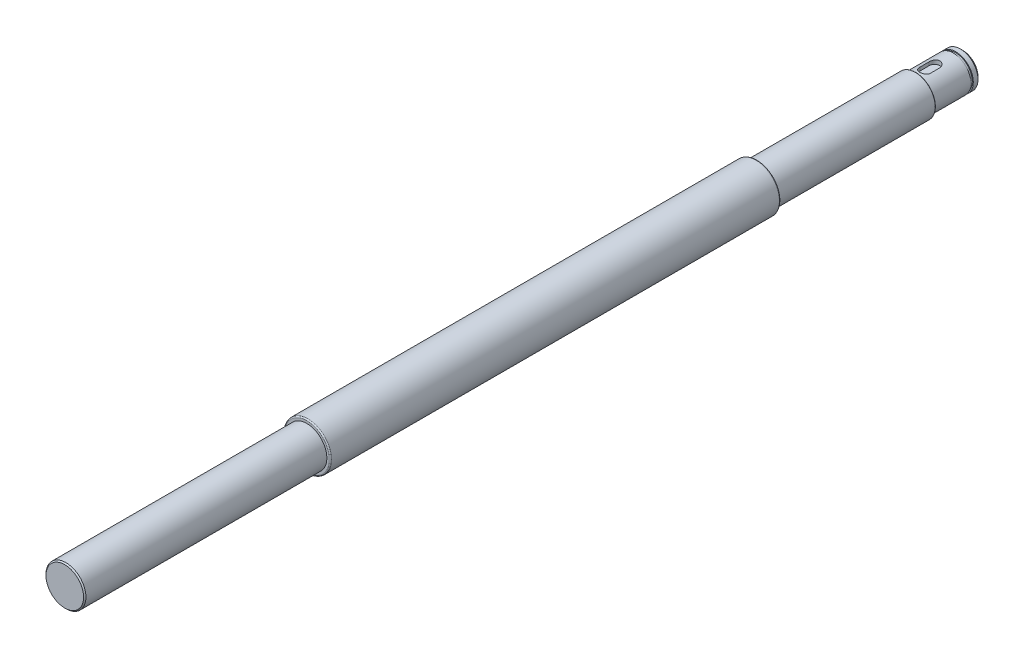
ISO-10303-21;
HEADER;
FILE_DESCRIPTION(('STEP AP214'),'2;1');
FILE_NAME('part.step','',(''),(''),'','','');
FILE_SCHEMA(('AUTOMOTIVE_DESIGN { 1 0 10303 214 1 1 1 1 }'));
ENDSEC;
DATA;
#1=APPLICATION_CONTEXT('core data for automotive mechanical design processes');
#2=APPLICATION_PROTOCOL_DEFINITION('international standard','automotive_design',2000,#1);
#3=PRODUCT_CONTEXT('',#1,'mechanical');
#4=PRODUCT('Part','Part','',(#3));
#5=PRODUCT_RELATED_PRODUCT_CATEGORY('part','',(#4));
#6=PRODUCT_DEFINITION_FORMATION('','',#4);
#7=PRODUCT_DEFINITION_CONTEXT('part definition',#1,'design');
#8=PRODUCT_DEFINITION('design','',#6,#7);
#9=PRODUCT_DEFINITION_SHAPE('','',#8);
#10=(LENGTH_UNIT() NAMED_UNIT(*) SI_UNIT(.MILLI.,.METRE.));
#11=(NAMED_UNIT(*) PLANE_ANGLE_UNIT() SI_UNIT($,.RADIAN.));
#12=(NAMED_UNIT(*) SI_UNIT($,.STERADIAN.) SOLID_ANGLE_UNIT());
#13=UNCERTAINTY_MEASURE_WITH_UNIT(LENGTH_MEASURE(1.E-05),#10,'distance_accuracy_value','');
#14=(GEOMETRIC_REPRESENTATION_CONTEXT(3) GLOBAL_UNCERTAINTY_ASSIGNED_CONTEXT((#13)) GLOBAL_UNIT_ASSIGNED_CONTEXT((#10,
#11,#12)) REPRESENTATION_CONTEXT('',''));
#15=CARTESIAN_POINT('',(0.,0.,0.));
#16=DIRECTION('',(0.,0.,1.));
#17=DIRECTION('',(1.,0.,0.));
#18=AXIS2_PLACEMENT_3D('',#15,#16,#17);
#19=CARTESIAN_POINT('',(0.,0.,-67.5));
#20=DIRECTION('',(0.,0.,-1.));
#21=DIRECTION('',(-1.,0.,0.));
#22=AXIS2_PLACEMENT_3D('',#19,#20,#21);
#23=PLANE('',#22);
#24=CARTESIAN_POINT('',(0.,0.,-67.5));
#25=DIRECTION('',(0.,0.,-1.));
#26=DIRECTION('',(-1.,0.,0.));
#27=AXIS2_PLACEMENT_3D('',#24,#25,#26);
#28=CIRCLE('',#27,8.25);
#29=CARTESIAN_POINT('',(-8.25,0.,-67.5));
#30=VERTEX_POINT('',#29);
#31=EDGE_CURVE('E241',#30,#30,#28,.T.);
#32=ORIENTED_EDGE('',*,*,#31,.T.);
#33=EDGE_LOOP('',(#32));
#34=FACE_BOUND('',#33,.T.);
#35=CARTESIAN_POINT('',(0.,0.,-67.5));
#36=DIRECTION('',(0.,0.,-1.));
#37=DIRECTION('',(-1.,0.,0.));
#38=AXIS2_PLACEMENT_3D('',#35,#36,#37);
#39=CIRCLE('',#38,7.5);
#40=CARTESIAN_POINT('',(-7.5,0.,-67.5));
#41=VERTEX_POINT('',#40);
#42=EDGE_CURVE('E116',#41,#41,#39,.T.);
#43=ORIENTED_EDGE('',*,*,#42,.F.);
#44=EDGE_LOOP('',(#43));
#45=FACE_BOUND('',#44,.T.);
#46=ADVANCED_FACE('F41',(#34,#45),#23,.T.);
#47=CARTESIAN_POINT('',(0.,0.,0.));
#48=DIRECTION('',(0.,0.,1.));
#49=DIRECTION('',(1.,0.,0.));
#50=AXIS2_PLACEMENT_3D('',#47,#48,#49);
#51=PLANE('',#50);
#52=CARTESIAN_POINT('',(0.,0.,0.));
#53=DIRECTION('',(0.,0.,1.));
#54=DIRECTION('',(1.,0.,0.));
#55=AXIS2_PLACEMENT_3D('',#52,#53,#54);
#56=CIRCLE('',#55,9.5);
#57=CARTESIAN_POINT('',(9.5,0.,0.));
#58=VERTEX_POINT('',#57);
#59=EDGE_CURVE('E137',#58,#58,#56,.F.);
#60=ORIENTED_EDGE('',*,*,#59,.T.);
#61=EDGE_LOOP('',(#60));
#62=FACE_BOUND('',#61,.T.);
#63=CARTESIAN_POINT('',(0.,0.,0.));
#64=DIRECTION('',(0.,0.,1.));
#65=DIRECTION('',(1.,0.,0.));
#66=AXIS2_PLACEMENT_3D('',#63,#64,#65);
#67=CIRCLE('',#66,8.5);
#68=CARTESIAN_POINT('',(8.5,0.,0.));
#69=VERTEX_POINT('',#68);
#70=EDGE_CURVE('E125',#69,#69,#67,.F.);
#71=ORIENTED_EDGE('',*,*,#70,.F.);
#72=EDGE_LOOP('',(#71));
#73=FACE_BOUND('',#72,.T.);
#74=ADVANCED_FACE('F184',(#62,#73),#51,.F.);
#75=CARTESIAN_POINT('',(0.,0.,191.5));
#76=DIRECTION('',(0.,0.,1.));
#77=DIRECTION('',(1.,0.,0.));
#78=AXIS2_PLACEMENT_3D('',#75,#76,#77);
#79=PLANE('',#78);
#80=CARTESIAN_POINT('',(0.,0.,191.5));
#81=DIRECTION('',(0.,0.,1.));
#82=DIRECTION('',(1.,0.,0.));
#83=AXIS2_PLACEMENT_3D('',#80,#81,#82);
#84=CIRCLE('',#83,9.5);
#85=CARTESIAN_POINT('',(9.5,0.,191.5));
#86=VERTEX_POINT('',#85);
#87=EDGE_CURVE('E128',#86,#86,#84,.T.);
#88=ORIENTED_EDGE('',*,*,#87,.T.);
#89=EDGE_LOOP('',(#88));
#90=FACE_BOUND('',#89,.T.);
#91=CARTESIAN_POINT('',(0.,0.,191.5));
#92=DIRECTION('',(0.,0.,1.));
#93=DIRECTION('',(1.,0.,0.));
#94=AXIS2_PLACEMENT_3D('',#91,#92,#93);
#95=CIRCLE('',#94,8.5);
#96=CARTESIAN_POINT('',(8.5,0.,191.5));
#97=VERTEX_POINT('',#96);
#98=EDGE_CURVE('E122',#97,#97,#95,.T.);
#99=ORIENTED_EDGE('',*,*,#98,.F.);
#100=EDGE_LOOP('',(#99));
#101=FACE_BOUND('',#100,.T.);
#102=ADVANCED_FACE('F189',(#90,#101),#79,.T.);
#103=CARTESIAN_POINT('',(0.,0.,191.5));
#104=DIRECTION('',(0.,0.,-1.));
#105=DIRECTION('',(-1.,0.,0.));
#106=AXIS2_PLACEMENT_3D('',#103,#104,#105);
#107=CYLINDRICAL_SURFACE('',#106,10.);
#108=CARTESIAN_POINT('',(0.,0.,0.5));
#109=DIRECTION('',(0.,0.,1.));
#110=DIRECTION('',(1.,0.,0.));
#111=AXIS2_PLACEMENT_3D('',#108,#109,#110);
#112=CIRCLE('',#111,10.);
#113=CARTESIAN_POINT('',(10.,0.,0.5));
#114=VERTEX_POINT('',#113);
#115=EDGE_CURVE('E134',#114,#114,#112,.T.);
#116=ORIENTED_EDGE('',*,*,#115,.T.);
#117=EDGE_LOOP('',(#116));
#118=FACE_BOUND('',#117,.T.);
#119=CARTESIAN_POINT('',(0.,0.,191.));
#120=DIRECTION('',(0.,0.,1.));
#121=DIRECTION('',(1.,0.,0.));
#122=AXIS2_PLACEMENT_3D('',#119,#120,#121);
#123=CIRCLE('',#122,10.);
#124=CARTESIAN_POINT('',(10.,0.,191.));
#125=VERTEX_POINT('',#124);
#126=EDGE_CURVE('E131',#125,#125,#123,.F.);
#127=ORIENTED_EDGE('',*,*,#126,.T.);
#128=EDGE_LOOP('',(#127));
#129=FACE_BOUND('',#128,.T.);
#130=ADVANCED_FACE('F207',(#118,#129),#107,.T.);
#131=CARTESIAN_POINT('',(0.,0.,294.5));
#132=DIRECTION('',(0.,0.,-1.));
#133=DIRECTION('',(-1.,0.,0.));
#134=AXIS2_PLACEMENT_3D('',#131,#132,#133);
#135=CYLINDRICAL_SURFACE('',#134,8.5);
#136=CARTESIAN_POINT('',(0.,0.,294.));
#137=DIRECTION('',(0.,0.,1.));
#138=DIRECTION('',(1.,0.,0.));
#139=AXIS2_PLACEMENT_3D('',#136,#137,#138);
#140=CIRCLE('',#139,8.5);
#141=CARTESIAN_POINT('',(8.5,0.,294.));
#142=VERTEX_POINT('',#141);
#143=EDGE_CURVE('E12',#142,#142,#140,.F.);
#144=ORIENTED_EDGE('',*,*,#143,.T.);
#145=EDGE_LOOP('',(#144));
#146=FACE_BOUND('',#145,.T.);
#147=ORIENTED_EDGE('',*,*,#98,.T.);
#148=EDGE_LOOP('',(#147));
#149=FACE_BOUND('',#148,.T.);
#150=ADVANCED_FACE('F203',(#146,#149),#135,.T.);
#151=CARTESIAN_POINT('',(0.,0.,294.5));
#152=DIRECTION('',(0.,0.,1.));
#153=DIRECTION('',(1.,0.,0.));
#154=AXIS2_PLACEMENT_3D('',#151,#152,#153);
#155=PLANE('',#154);
#156=CARTESIAN_POINT('',(0.,0.,294.5));
#157=DIRECTION('',(0.,0.,1.));
#158=DIRECTION('',(1.,0.,0.));
#159=AXIS2_PLACEMENT_3D('',#156,#157,#158);
#160=CIRCLE('',#159,8.00000000000001);
#161=CARTESIAN_POINT('',(8.00000000000001,0.,294.5));
#162=VERTEX_POINT('',#161);
#163=EDGE_CURVE('E49',#162,#162,#160,.T.);
#164=ORIENTED_EDGE('',*,*,#163,.T.);
#165=EDGE_LOOP('',(#164));
#166=FACE_BOUND('',#165,.T.);
#167=ADVANCED_FACE('F199',(#166),#155,.T.);
#168=CARTESIAN_POINT('',(0.,0.,-67.5));
#169=DIRECTION('',(0.,0.,1.));
#170=DIRECTION('',(1.,0.,0.));
#171=AXIS2_PLACEMENT_3D('',#168,#169,#170);
#172=CYLINDRICAL_SURFACE('',#171,8.5);
#173=CARTESIAN_POINT('',(0.,0.,-67.25));
#174=DIRECTION('',(0.,0.,-1.));
#175=DIRECTION('',(-1.,0.,0.));
#176=AXIS2_PLACEMENT_3D('',#173,#174,#175);
#177=CIRCLE('',#176,8.5);
#178=CARTESIAN_POINT('',(-8.5,0.,-67.25));
#179=VERTEX_POINT('',#178);
#180=EDGE_CURVE('E237',#179,#179,#177,.F.);
#181=ORIENTED_EDGE('',*,*,#180,.T.);
#182=EDGE_LOOP('',(#181));
#183=FACE_BOUND('',#182,.T.);
#184=ORIENTED_EDGE('',*,*,#70,.T.);
#185=EDGE_LOOP('',(#184));
#186=FACE_BOUND('',#185,.T.);
#187=ADVANCED_FACE('F195',(#183,#186),#172,.T.);
#188=CARTESIAN_POINT('',(0.,0.,191.));
#189=DIRECTION('',(0.,0.,1.));
#190=DIRECTION('',(1.,0.,0.));
#191=AXIS2_PLACEMENT_3D('',#188,#189,#190);
#192=TOROIDAL_SURFACE('',#191,9.5,0.5);
#193=ORIENTED_EDGE('',*,*,#126,.F.);
#194=EDGE_LOOP('',(#193));
#195=FACE_BOUND('',#194,.T.);
#196=ORIENTED_EDGE('',*,*,#87,.F.);
#197=EDGE_LOOP('',(#196));
#198=FACE_BOUND('',#197,.T.);
#199=ADVANCED_FACE('F198',(#195,#198),#192,.T.);
#200=CARTESIAN_POINT('',(0.,0.,0.5));
#201=DIRECTION('',(0.,0.,1.));
#202=DIRECTION('',(1.,0.,0.));
#203=AXIS2_PLACEMENT_3D('',#200,#201,#202);
#204=TOROIDAL_SURFACE('',#203,9.5,0.5);
#205=ORIENTED_EDGE('',*,*,#59,.F.);
#206=EDGE_LOOP('',(#205));
#207=FACE_BOUND('',#206,.T.);
#208=ORIENTED_EDGE('',*,*,#115,.F.);
#209=EDGE_LOOP('',(#208));
#210=FACE_BOUND('',#209,.T.);
#211=ADVANCED_FACE('F217',(#207,#210),#204,.T.);
#212=CARTESIAN_POINT('',(0.,0.,-87.5));
#213=DIRECTION('',(0.,0.,1.));
#214=DIRECTION('',(1.,0.,0.));
#215=AXIS2_PLACEMENT_3D('',#212,#213,#214);
#216=CYLINDRICAL_SURFACE('',#215,7.5);
#217=CARTESIAN_POINT('',(0.,0.,-83.5));
#218=DIRECTION('',(0.,0.,1.));
#219=DIRECTION('',(1.,0.,0.));
#220=AXIS2_PLACEMENT_3D('',#217,#218,#219);
#221=CIRCLE('',#220,7.5);
#222=CARTESIAN_POINT('',(7.5,0.,-83.5));
#223=VERTEX_POINT('',#222);
#224=EDGE_CURVE('E106',#223,#223,#221,.T.);
#225=ORIENTED_EDGE('',*,*,#224,.T.);
#226=EDGE_LOOP('',(#225));
#227=FACE_BOUND('',#226,.T.);
#228=DIRECTION('',(0.,0.,1.));
#229=VECTOR('',#228,1.);
#230=CARTESIAN_POINT('',(2.25,7.15454401062709,-87.5));
#231=LINE('',#230,#229);
#232=CARTESIAN_POINT('',(2.25,7.15454401062709,-75.5));
#233=VERTEX_POINT('',#232);
#234=CARTESIAN_POINT('',(2.25,7.15454401062709,-71.5));
#235=VERTEX_POINT('',#234);
#236=EDGE_CURVE('E64',#233,#235,#231,.T.);
#237=ORIENTED_EDGE('',*,*,#236,.T.);
#238=CARTESIAN_POINT('',(2.25,7.15454401062709,-71.5));
#239=CARTESIAN_POINT('',(2.25000770884296,7.15453540686155,-71.438248359383));
#240=CARTESIAN_POINT('',(2.24745797013354,7.15534329048284,-71.3765016587026));
#241=CARTESIAN_POINT('',(2.2373035717451,7.15852809079489,-71.2534795354259));
#242=CARTESIAN_POINT('',(2.22970004854064,7.16090465472637,-71.1922040100067));
#243=CARTESIAN_POINT('',(2.20952355468783,7.16715501263252,-71.0707113132451));
#244=CARTESIAN_POINT('',(2.19696320218302,7.17102500437586,-71.0104918569677));
#245=CARTESIAN_POINT('',(2.16699639772795,7.18013719988384,-70.8913931168993));
#246=CARTESIAN_POINT('',(2.1495898190448,7.18537943953371,-70.8325138681995));
#247=CARTESIAN_POINT('',(2.09031438334518,7.20293728240602,-70.6585379590074));
#248=CARTESIAN_POINT('',(2.04136389407229,7.21709255872793,-70.5459486708752));
#249=CARTESIAN_POINT('',(1.92611282648456,7.24869910475864,-70.3305804670157));
#250=CARTESIAN_POINT('',(1.8598041744312,7.26615190717981,-70.2278061469284));
#251=CARTESIAN_POINT('',(1.70947409725832,7.30300237886531,-70.0317077590391));
#252=CARTESIAN_POINT('',(1.62500186059938,7.32244129102405,-69.9387363444543));
#253=CARTESIAN_POINT('',(1.44170802112825,7.36072221356308,-69.7680447888709));
#254=CARTESIAN_POINT('',(1.34288399886122,7.37956412264557,-69.6903272246042));
#255=CARTESIAN_POINT('',(1.13116498099272,7.41499858482401,-69.5508048511791));
#256=CARTESIAN_POINT('',(1.01802125550761,7.43153656160158,-69.489362365163));
#257=CARTESIAN_POINT('',(0.782431751762266,7.46001705066108,-69.3865172469978));
#258=CARTESIAN_POINT('',(0.659988381515985,7.47196074774302,-69.345109447474));
#259=CARTESIAN_POINT('',(0.412987053615448,7.48961459826298,-69.2846803361568));
#260=CARTESIAN_POINT('',(0.288589689762149,7.49549323895094,-69.2650527223618));
#261=CARTESIAN_POINT('',(0.0381353561766912,7.5009480305403,-69.2468239786405));
#262=CARTESIAN_POINT('',(-0.087921294844009,7.50052537462588,-69.2482188679914));
#263=CARTESIAN_POINT('',(-0.333857399453874,7.49354403844189,-69.2715893655186));
#264=CARTESIAN_POINT('',(-0.453805718072277,7.48718123262384,-69.2929080181061));
#265=CARTESIAN_POINT('',(-0.688335078277741,7.46927270551367,-69.3544474522191));
#266=CARTESIAN_POINT('',(-0.802915838331597,7.45772671269419,-69.394669224012));
#267=CARTESIAN_POINT('',(-1.02502172380434,7.43047822388836,-69.4933183326436));
#268=CARTESIAN_POINT('',(-1.1324490090571,7.41472883538686,-69.5519524665821));
#269=CARTESIAN_POINT('',(-1.33614829437076,7.38074436977735,-69.6855978850258));
#270=CARTESIAN_POINT('',(-1.43241778742438,7.36250873603854,-69.7606128392055));
#271=CARTESIAN_POINT('',(-1.61498175811654,7.32467510357085,-69.9282879821385));
#272=CARTESIAN_POINT('',(-1.70075027216982,7.30505168174323,-70.0215157956447));
#273=CARTESIAN_POINT('',(-1.855601542388,7.26726322671995,-70.2212461351383));
#274=CARTESIAN_POINT('',(-1.92467943019635,7.2490986200635,-70.3277525205473));
#275=CARTESIAN_POINT('',(-2.04474610861276,7.21615843193477,-70.5524213926749));
#276=CARTESIAN_POINT('',(-2.09554509511697,7.20141894368922,-70.6706907693904));
#277=CARTESIAN_POINT('',(-2.17628829007053,7.17743495479802,-70.9145867559724));
#278=CARTESIAN_POINT('',(-2.20626439827054,7.16818205213812,-71.0402017910715));
#279=CARTESIAN_POINT('',(-2.23351805385119,7.15971048487509,-71.2224923336053));
#280=CARTESIAN_POINT('',(-2.23969804483513,7.157777344129,-71.2778361012694));
#281=CARTESIAN_POINT('',(-2.24793533422281,7.15519392917673,-71.3887772186493));
#282=CARTESIAN_POINT('',(-2.24999869452403,7.15454176869966,-71.4443740744958));
#283=CARTESIAN_POINT('',(-2.25,7.15454401062709,-71.5));
#284=B_SPLINE_CURVE_WITH_KNOTS('',3,(#238,#239,#240,#241,#242,#243,#244,#245,#246,#247,#248,
#249,#250,#251,#252,#253,#254,#255,#256,#257,#258,#259,#260,#261,#262,#263,#264,#265,#266,#267,
#268,#269,#270,#271,#272,#273,#274,#275,#276,#277,#278,#279,#280,#281,#282,#283),.UNSPECIFIED.,
.F.,.F.,(4,2,2,2,2,2,2,2,2,2,2,2,2,2,2,2,2,2,2,2,2,2,4),(0.,0.185188606829606,0.370335583279574,
0.555014257217274,0.739697761111524,1.10860010551519,1.47767434193084,1.85726339867074,
2.23691652179275,2.62442107965053,3.01182563843754,3.38815200648573,3.76440711603076,
4.1286776868832,4.49296734270624,4.86150437512966,5.23012405304377,5.61291926135342,
5.99582598974035,6.3826012077616,6.76878258829182,6.93580700787584,7.10258529549293),.UNSPECIFIED.);
#285=CARTESIAN_POINT('',(-2.25,7.15454401062709,-71.5));
#286=VERTEX_POINT('',#285);
#287=EDGE_CURVE('E140',#235,#286,#284,.T.);
#288=ORIENTED_EDGE('',*,*,#287,.T.);
#289=DIRECTION('',(0.,0.,1.));
#290=VECTOR('',#289,1.);
#291=CARTESIAN_POINT('',(-2.25,7.15454401062709,-87.5));
#292=LINE('',#291,#290);
#293=CARTESIAN_POINT('',(-2.25,7.15454401062709,-75.5));
#294=VERTEX_POINT('',#293);
#295=EDGE_CURVE('E251',#286,#294,#292,.F.);
#296=ORIENTED_EDGE('',*,*,#295,.T.);
#297=CARTESIAN_POINT('',(-2.25,7.15454401062709,-75.5));
#298=CARTESIAN_POINT('',(-2.25000770884296,7.15453540686155,-75.561751640617));
#299=CARTESIAN_POINT('',(-2.24745797013354,7.15534329048284,-75.6234983412974));
#300=CARTESIAN_POINT('',(-2.2373035717451,7.15852809079489,-75.7465204645741));
#301=CARTESIAN_POINT('',(-2.22970004854064,7.16090465472637,-75.8077959899933));
#302=CARTESIAN_POINT('',(-2.20952355468783,7.16715501263252,-75.9292886867549));
#303=CARTESIAN_POINT('',(-2.19696320218302,7.17102500437586,-75.9895081430323));
#304=CARTESIAN_POINT('',(-2.16699639772796,7.18013719988384,-76.1086068831007));
#305=CARTESIAN_POINT('',(-2.1495898190448,7.18537943953371,-76.1674861318006));
#306=CARTESIAN_POINT('',(-2.09031438334518,7.20293728240602,-76.3414620409926));
#307=CARTESIAN_POINT('',(-2.0413638940723,7.21709255872793,-76.4540513291248));
#308=CARTESIAN_POINT('',(-1.92611282648458,7.24869910475864,-76.6694195329843));
#309=CARTESIAN_POINT('',(-1.8598041744312,7.2661519071798,-76.7721938530716));
#310=CARTESIAN_POINT('',(-1.70947409725832,7.30300237886531,-76.9682922409609));
#311=CARTESIAN_POINT('',(-1.62500186059938,7.32244129102405,-77.0612636555457));
#312=CARTESIAN_POINT('',(-1.44170802112825,7.36072221356308,-77.2319552111291));
#313=CARTESIAN_POINT('',(-1.34288399886122,7.37956412264557,-77.3096727753958));
#314=CARTESIAN_POINT('',(-1.13116498099272,7.41499858482401,-77.4491951488209));
#315=CARTESIAN_POINT('',(-1.01802125550761,7.43153656160158,-77.510637634837));
#316=CARTESIAN_POINT('',(-0.782431751762267,7.46001705066108,-77.6134827530022));
#317=CARTESIAN_POINT('',(-0.659988381515987,7.47196074774302,-77.654890552526));
#318=CARTESIAN_POINT('',(-0.41298705361545,7.48961459826298,-77.7153196638433));
#319=CARTESIAN_POINT('',(-0.28858968976215,7.49549323895094,-77.7349472776382));
#320=CARTESIAN_POINT('',(-0.0381353561766931,7.5009480305403,-77.7531760213596));
#321=CARTESIAN_POINT('',(0.0879212948440073,7.50052537462588,-77.7517811320086));
#322=CARTESIAN_POINT('',(0.333857399453873,7.49354403844189,-77.7284106344814));
#323=CARTESIAN_POINT('',(0.453805718072276,7.48718123262384,-77.7070919818939));
#324=CARTESIAN_POINT('',(0.68833507827774,7.46927270551367,-77.6455525477809));
#325=CARTESIAN_POINT('',(0.802915838331596,7.45772671269419,-77.605330775988));
#326=CARTESIAN_POINT('',(1.02502172380434,7.43047822388836,-77.5066816673565));
#327=CARTESIAN_POINT('',(1.1324490090571,7.41472883538686,-77.4480475334179));
#328=CARTESIAN_POINT('',(1.33614829437075,7.38074436977735,-77.3144021149742));
#329=CARTESIAN_POINT('',(1.43241778742438,7.36250873603854,-77.2393871607945));
#330=CARTESIAN_POINT('',(1.61498175811654,7.32467510357085,-77.0717120178615));
#331=CARTESIAN_POINT('',(1.70075027216982,7.30505168174323,-76.9784842043554));
#332=CARTESIAN_POINT('',(1.855601542388,7.26726322671995,-76.7787538648617));
#333=CARTESIAN_POINT('',(1.92467943019635,7.2490986200635,-76.6722474794527));
#334=CARTESIAN_POINT('',(2.04474610861276,7.21615843193477,-76.4475786073251));
#335=CARTESIAN_POINT('',(2.09554509511696,7.20141894368922,-76.3293092306097));
#336=CARTESIAN_POINT('',(2.17628829007053,7.17743495479802,-76.0854132440277));
#337=CARTESIAN_POINT('',(2.20626439827054,7.16818205213812,-75.9597982089285));
#338=CARTESIAN_POINT('',(2.23351805385119,7.15971048487509,-75.7775076663947));
#339=CARTESIAN_POINT('',(2.23969804483513,7.157777344129,-75.7221638987306));
#340=CARTESIAN_POINT('',(2.24793533422281,7.15519392917673,-75.6112227813507));
#341=CARTESIAN_POINT('',(2.24999869452403,7.15454176869966,-75.5556259255042));
#342=CARTESIAN_POINT('',(2.25,7.15454401062709,-75.5));
#343=B_SPLINE_CURVE_WITH_KNOTS('',3,(#297,#298,#299,#300,#301,#302,#303,#304,#305,#306,#307,
#308,#309,#310,#311,#312,#313,#314,#315,#316,#317,#318,#319,#320,#321,#322,#323,#324,#325,#326,
#327,#328,#329,#330,#331,#332,#333,#334,#335,#336,#337,#338,#339,#340,#341,#342),.UNSPECIFIED.,
.F.,.F.,(4,2,2,2,2,2,2,2,2,2,2,2,2,2,2,2,2,2,2,2,2,2,4),(0.,0.185188606829606,0.370335583279574,
0.555014257217274,0.739697761111524,1.10860010551516,1.47767434193084,1.85726339867074,
2.23691652179275,2.62442107965053,3.01182563843754,3.38815200648573,3.76440711603076,
4.1286776868832,4.49296734270624,4.86150437512966,5.23012405304377,5.61291926135341,
5.99582598974035,6.38260120776159,6.7687825882918,6.93580700787581,7.10258529549293),.UNSPECIFIED.);
#344=EDGE_CURVE('E56',#294,#233,#343,.T.);
#345=ORIENTED_EDGE('',*,*,#344,.T.);
#346=EDGE_LOOP('',(#237,#288,#296,#345));
#347=FACE_BOUND('',#346,.T.);
#348=ORIENTED_EDGE('',*,*,#42,.T.);
#349=EDGE_LOOP('',(#348));
#350=FACE_BOUND('',#349,.T.);
#351=ADVANCED_FACE('F153',(#227,#347,#350),#216,.T.);
#352=CARTESIAN_POINT('',(0.,5.7,-75.5));
#353=DIRECTION('',(0.,1.,0.));
#354=DIRECTION('',(0.,0.,1.));
#355=AXIS2_PLACEMENT_3D('',#352,#353,#354);
#356=CYLINDRICAL_SURFACE('',#355,2.25);
#357=DIRECTION('',(0.,1.,0.));
#358=VECTOR('',#357,1.);
#359=CARTESIAN_POINT('',(-2.25,5.7,-75.5));
#360=LINE('',#359,#358);
#361=CARTESIAN_POINT('',(-2.25,5.7,-75.5));
#362=VERTEX_POINT('',#361);
#363=EDGE_CURVE('E81',#362,#294,#360,.T.);
#364=ORIENTED_EDGE('',*,*,#363,.F.);
#365=CARTESIAN_POINT('',(0.,5.7,-75.5));
#366=DIRECTION('',(0.,1.,0.));
#367=DIRECTION('',(0.,0.,-1.));
#368=AXIS2_PLACEMENT_3D('',#365,#366,#367);
#369=CIRCLE('',#368,2.25);
#370=CARTESIAN_POINT('',(2.25,5.7,-75.5));
#371=VERTEX_POINT('',#370);
#372=EDGE_CURVE('E85',#371,#362,#369,.T.);
#373=ORIENTED_EDGE('',*,*,#372,.F.);
#374=DIRECTION('',(0.,1.,0.));
#375=VECTOR('',#374,1.);
#376=CARTESIAN_POINT('',(2.25,5.7,-75.5));
#377=LINE('',#376,#375);
#378=EDGE_CURVE('E114',#371,#233,#377,.T.);
#379=ORIENTED_EDGE('',*,*,#378,.T.);
#380=ORIENTED_EDGE('',*,*,#344,.F.);
#381=EDGE_LOOP('',(#364,#373,#379,#380));
#382=FACE_BOUND('',#381,.T.);
#383=ADVANCED_FACE('F83',(#382),#356,.F.);
#384=CARTESIAN_POINT('',(2.25,5.7,-75.5));
#385=DIRECTION('',(1.,0.,0.));
#386=DIRECTION('',(0.,0.,-1.));
#387=AXIS2_PLACEMENT_3D('',#384,#385,#386);
#388=PLANE('',#387);
#389=ORIENTED_EDGE('',*,*,#378,.F.);
#390=DIRECTION('',(0.,0.,-1.));
#391=VECTOR('',#390,1.);
#392=CARTESIAN_POINT('',(2.25,5.7,-75.5));
#393=LINE('',#392,#391);
#394=CARTESIAN_POINT('',(2.25,5.7,-71.5));
#395=VERTEX_POINT('',#394);
#396=EDGE_CURVE('E90',#395,#371,#393,.T.);
#397=ORIENTED_EDGE('',*,*,#396,.F.);
#398=DIRECTION('',(0.,1.,0.));
#399=VECTOR('',#398,1.);
#400=CARTESIAN_POINT('',(2.25,5.7,-71.5));
#401=LINE('',#400,#399);
#402=EDGE_CURVE('E117',#395,#235,#401,.T.);
#403=ORIENTED_EDGE('',*,*,#402,.T.);
#404=ORIENTED_EDGE('',*,*,#236,.F.);
#405=EDGE_LOOP('',(#389,#397,#403,#404));
#406=FACE_BOUND('',#405,.T.);
#407=ADVANCED_FACE('F162',(#406),#388,.F.);
#408=CARTESIAN_POINT('',(0.,5.7,-71.5));
#409=DIRECTION('',(0.,1.,0.));
#410=DIRECTION('',(0.,0.,1.));
#411=AXIS2_PLACEMENT_3D('',#408,#409,#410);
#412=CYLINDRICAL_SURFACE('',#411,2.25);
#413=ORIENTED_EDGE('',*,*,#402,.F.);
#414=CARTESIAN_POINT('',(0.,5.7,-71.5));
#415=DIRECTION('',(0.,1.,0.));
#416=DIRECTION('',(0.,0.,1.));
#417=AXIS2_PLACEMENT_3D('',#414,#415,#416);
#418=CIRCLE('',#417,2.25);
#419=CARTESIAN_POINT('',(-2.25,5.7,-71.5));
#420=VERTEX_POINT('',#419);
#421=EDGE_CURVE('E99',#420,#395,#418,.T.);
#422=ORIENTED_EDGE('',*,*,#421,.F.);
#423=DIRECTION('',(0.,1.,0.));
#424=VECTOR('',#423,1.);
#425=CARTESIAN_POINT('',(-2.25,5.7,-71.5));
#426=LINE('',#425,#424);
#427=EDGE_CURVE('E89',#420,#286,#426,.T.);
#428=ORIENTED_EDGE('',*,*,#427,.T.);
#429=ORIENTED_EDGE('',*,*,#287,.F.);
#430=EDGE_LOOP('',(#413,#422,#428,#429));
#431=FACE_BOUND('',#430,.T.);
#432=ADVANCED_FACE('F157',(#431),#412,.F.);
#433=CARTESIAN_POINT('',(-2.25,5.7,-75.5));
#434=DIRECTION('',(-1.,0.,0.));
#435=DIRECTION('',(0.,0.,1.));
#436=AXIS2_PLACEMENT_3D('',#433,#434,#435);
#437=PLANE('',#436);
#438=ORIENTED_EDGE('',*,*,#427,.F.);
#439=DIRECTION('',(0.,0.,1.));
#440=VECTOR('',#439,1.);
#441=CARTESIAN_POINT('',(-2.25,5.7,-75.5));
#442=LINE('',#441,#440);
#443=EDGE_CURVE('E93',#362,#420,#442,.T.);
#444=ORIENTED_EDGE('',*,*,#443,.F.);
#445=ORIENTED_EDGE('',*,*,#363,.T.);
#446=ORIENTED_EDGE('',*,*,#295,.F.);
#447=EDGE_LOOP('',(#438,#444,#445,#446));
#448=FACE_BOUND('',#447,.T.);
#449=ADVANCED_FACE('F94',(#448),#437,.F.);
#450=CARTESIAN_POINT('',(0.,5.7,-75.5));
#451=DIRECTION('',(0.,-1.,0.));
#452=DIRECTION('',(0.,0.,-1.));
#453=AXIS2_PLACEMENT_3D('',#450,#451,#452);
#454=PLANE('',#453);
#455=ORIENTED_EDGE('',*,*,#372,.T.);
#456=ORIENTED_EDGE('',*,*,#443,.T.);
#457=ORIENTED_EDGE('',*,*,#421,.T.);
#458=ORIENTED_EDGE('',*,*,#396,.T.);
#459=EDGE_LOOP('',(#455,#456,#457,#458));
#460=FACE_BOUND('',#459,.T.);
#461=ADVANCED_FACE('F101',(#460),#454,.F.);
#462=CARTESIAN_POINT('',(0.,0.,-84.5));
#463=DIRECTION('',(0.,0.,1.));
#464=DIRECTION('',(1.,0.,0.));
#465=AXIS2_PLACEMENT_3D('',#462,#463,#464);
#466=PLANE('',#465);
#467=CARTESIAN_POINT('',(0.,0.,-84.5));
#468=DIRECTION('',(0.,0.,1.));
#469=DIRECTION('',(1.,0.,0.));
#470=AXIS2_PLACEMENT_3D('',#467,#468,#469);
#471=CIRCLE('',#470,7.075);
#472=CARTESIAN_POINT('',(7.075,0.,-84.5));
#473=VERTEX_POINT('',#472);
#474=EDGE_CURVE('E250',#473,#473,#471,.T.);
#475=ORIENTED_EDGE('',*,*,#474,.F.);
#476=EDGE_LOOP('',(#475));
#477=FACE_BOUND('',#476,.T.);
#478=CARTESIAN_POINT('',(0.,0.,-84.5));
#479=DIRECTION('',(0.,0.,1.));
#480=DIRECTION('',(1.,0.,0.));
#481=AXIS2_PLACEMENT_3D('',#478,#479,#480);
#482=CIRCLE('',#481,7.5);
#483=CARTESIAN_POINT('',(7.5,0.,-84.5));
#484=VERTEX_POINT('',#483);
#485=EDGE_CURVE('E103',#484,#484,#482,.T.);
#486=ORIENTED_EDGE('',*,*,#485,.T.);
#487=EDGE_LOOP('',(#486));
#488=FACE_BOUND('',#487,.T.);
#489=ADVANCED_FACE('F274',(#477,#488),#466,.T.);
#490=CARTESIAN_POINT('',(0.,0.,-83.5));
#491=DIRECTION('',(0.,0.,1.));
#492=DIRECTION('',(1.,0.,0.));
#493=AXIS2_PLACEMENT_3D('',#490,#491,#492);
#494=PLANE('',#493);
#495=CARTESIAN_POINT('',(0.,0.,-83.5));
#496=DIRECTION('',(0.,0.,1.));
#497=DIRECTION('',(1.,0.,0.));
#498=AXIS2_PLACEMENT_3D('',#495,#496,#497);
#499=CIRCLE('',#498,7.075);
#500=CARTESIAN_POINT('',(7.075,0.,-83.5));
#501=VERTEX_POINT('',#500);
#502=EDGE_CURVE('E109',#501,#501,#499,.T.);
#503=ORIENTED_EDGE('',*,*,#502,.T.);
#504=EDGE_LOOP('',(#503));
#505=FACE_BOUND('',#504,.T.);
#506=ORIENTED_EDGE('',*,*,#224,.F.);
#507=EDGE_LOOP('',(#506));
#508=FACE_BOUND('',#507,.T.);
#509=ADVANCED_FACE('F179',(#505,#508),#494,.F.);
#510=CARTESIAN_POINT('',(0.,0.,-84.5));
#511=DIRECTION('',(0.,0.,1.));
#512=DIRECTION('',(1.,0.,0.));
#513=AXIS2_PLACEMENT_3D('',#510,#511,#512);
#514=CYLINDRICAL_SURFACE('',#513,7.075);
#515=ORIENTED_EDGE('',*,*,#474,.T.);
#516=EDGE_LOOP('',(#515));
#517=FACE_BOUND('',#516,.T.);
#518=ORIENTED_EDGE('',*,*,#502,.F.);
#519=EDGE_LOOP('',(#518));
#520=FACE_BOUND('',#519,.T.);
#521=ADVANCED_FACE('F171',(#517,#520),#514,.T.);
#522=CARTESIAN_POINT('',(0.,0.,-87.5));
#523=DIRECTION('',(0.,0.,-1.));
#524=DIRECTION('',(-1.,0.,0.));
#525=AXIS2_PLACEMENT_3D('',#522,#523,#524);
#526=PLANE('',#525);
#527=CARTESIAN_POINT('',(0.,0.,-87.5));
#528=DIRECTION('',(0.,0.,-1.));
#529=DIRECTION('',(-1.,0.,0.));
#530=AXIS2_PLACEMENT_3D('',#527,#528,#529);
#531=CIRCLE('',#530,6.50000000000001);
#532=CARTESIAN_POINT('',(-6.50000000000001,0.,-87.5));
#533=VERTEX_POINT('',#532);
#534=EDGE_CURVE('E236',#533,#533,#531,.T.);
#535=ORIENTED_EDGE('',*,*,#534,.T.);
#536=EDGE_LOOP('',(#535));
#537=FACE_BOUND('',#536,.T.);
#538=ADVANCED_FACE('F168',(#537),#526,.T.);
#539=CARTESIAN_POINT('',(0.,0.,-86.5));
#540=DIRECTION('',(0.,0.,-1.));
#541=DIRECTION('',(-1.,0.,0.));
#542=AXIS2_PLACEMENT_3D('',#539,#540,#541);
#543=CIRCLE('',#542,7.5);
#544=CARTESIAN_POINT('',(-7.5,0.,-86.5));
#545=VERTEX_POINT('',#544);
#546=EDGE_CURVE('E234',#545,#545,#543,.F.);
#547=ORIENTED_EDGE('',*,*,#546,.T.);
#548=EDGE_LOOP('',(#547));
#549=FACE_BOUND('',#548,.T.);
#550=ORIENTED_EDGE('',*,*,#485,.F.);
#551=EDGE_LOOP('',(#550));
#552=FACE_BOUND('',#551,.T.);
#553=ADVANCED_FACE('F170',(#549,#552),#216,.T.);
#554=CARTESIAN_POINT('',(0.,0.,-67.25));
#555=DIRECTION('',(0.,0.,-1.));
#556=DIRECTION('',(-1.,0.,0.));
#557=AXIS2_PLACEMENT_3D('',#554,#555,#556);
#558=TOROIDAL_SURFACE('',#557,8.25,0.25);
#559=ORIENTED_EDGE('',*,*,#180,.F.);
#560=EDGE_LOOP('',(#559));
#561=FACE_BOUND('',#560,.T.);
#562=ORIENTED_EDGE('',*,*,#31,.F.);
#563=EDGE_LOOP('',(#562));
#564=FACE_BOUND('',#563,.T.);
#565=ADVANCED_FACE('F177',(#561,#564),#558,.T.);
#566=CARTESIAN_POINT('',(0.,0.,-87.5));
#567=DIRECTION('',(0.,0.,1.));
#568=DIRECTION('',(1.,0.,0.));
#569=AXIS2_PLACEMENT_3D('',#566,#567,#568);
#570=CONICAL_SURFACE('',#569,6.50000000000001,0.785398163397438);
#571=ORIENTED_EDGE('',*,*,#546,.F.);
#572=EDGE_LOOP('',(#571));
#573=FACE_BOUND('',#572,.T.);
#574=ORIENTED_EDGE('',*,*,#534,.F.);
#575=EDGE_LOOP('',(#574));
#576=FACE_BOUND('',#575,.T.);
#577=ADVANCED_FACE('F223',(#573,#576),#570,.T.);
#578=CARTESIAN_POINT('',(0.,0.,294.5));
#579=DIRECTION('',(0.,0.,-1.));
#580=DIRECTION('',(-1.,0.,0.));
#581=AXIS2_PLACEMENT_3D('',#578,#579,#580);
#582=CONICAL_SURFACE('',#581,8.00000000000001,0.785398163397441);
#583=ORIENTED_EDGE('',*,*,#143,.F.);
#584=EDGE_LOOP('',(#583));
#585=FACE_BOUND('',#584,.T.);
#586=ORIENTED_EDGE('',*,*,#163,.F.);
#587=EDGE_LOOP('',(#586));
#588=FACE_BOUND('',#587,.T.);
#589=ADVANCED_FACE('F43',(#585,#588),#582,.T.);
#590=CLOSED_SHELL('',(#46,#74,#102,#130,#150,#167,#187,#199,#211,#351,#383,#407,#432,#449,#461,
#489,#509,#521,#538,#553,#565,#577,#589));
#591=MANIFOLD_SOLID_BREP('B2',#590);
#592=ADVANCED_BREP_SHAPE_REPRESENTATION('',(#18,#591),#14);
#593=SHAPE_DEFINITION_REPRESENTATION(#9,#592);
ENDSEC;
END-ISO-10303-21;
